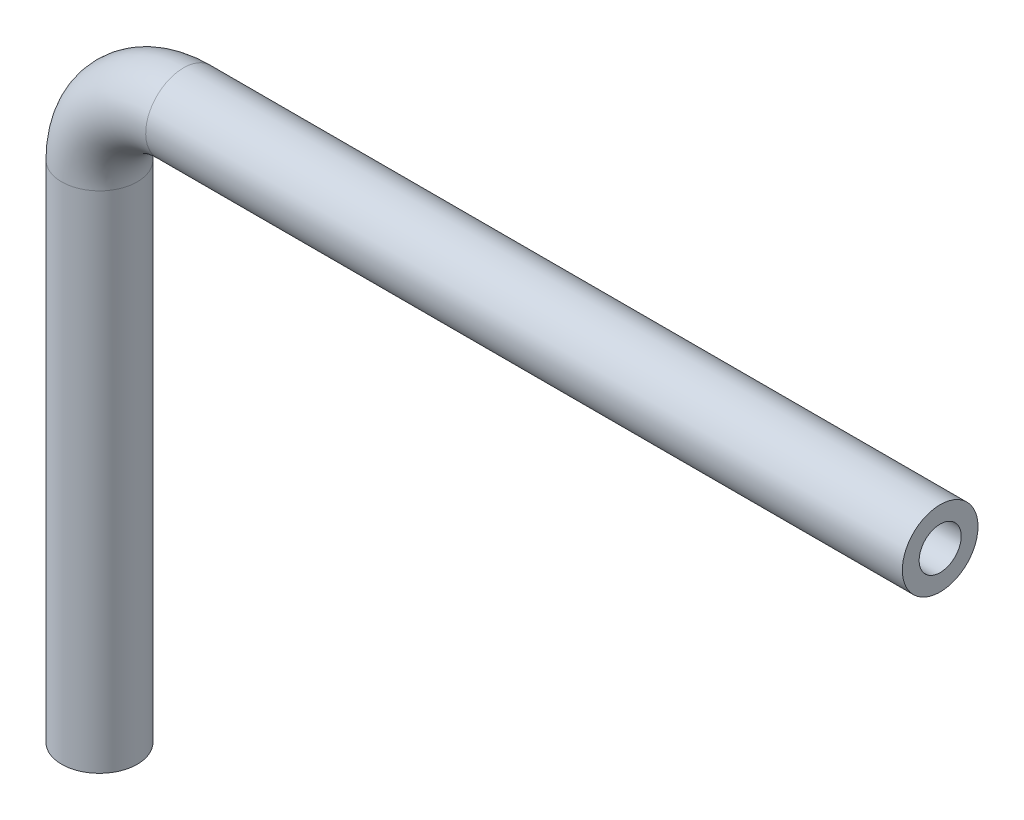
ISO-10303-21;
HEADER;
FILE_DESCRIPTION(('STEP AP214'),'2;1');
FILE_NAME('part.step','',(''),(''),'','','');
FILE_SCHEMA(('AUTOMOTIVE_DESIGN { 1 0 10303 214 1 1 1 1 }'));
ENDSEC;
DATA;
#1=APPLICATION_CONTEXT('core data for automotive mechanical design processes');
#2=APPLICATION_PROTOCOL_DEFINITION('international standard','automotive_design',2000,#1);
#3=PRODUCT_CONTEXT('',#1,'mechanical');
#4=PRODUCT('Part','Part','',(#3));
#5=PRODUCT_RELATED_PRODUCT_CATEGORY('part','',(#4));
#6=PRODUCT_DEFINITION_FORMATION('','',#4);
#7=PRODUCT_DEFINITION_CONTEXT('part definition',#1,'design');
#8=PRODUCT_DEFINITION('design','',#6,#7);
#9=PRODUCT_DEFINITION_SHAPE('','',#8);
#10=(LENGTH_UNIT() NAMED_UNIT(*) SI_UNIT(.MILLI.,.METRE.));
#11=(NAMED_UNIT(*) PLANE_ANGLE_UNIT() SI_UNIT($,.RADIAN.));
#12=(NAMED_UNIT(*) SI_UNIT($,.STERADIAN.) SOLID_ANGLE_UNIT());
#13=UNCERTAINTY_MEASURE_WITH_UNIT(LENGTH_MEASURE(1.E-05),#10,'distance_accuracy_value','');
#14=(GEOMETRIC_REPRESENTATION_CONTEXT(3) GLOBAL_UNCERTAINTY_ASSIGNED_CONTEXT((#13)) GLOBAL_UNIT_ASSIGNED_CONTEXT((#10,
#11,#12)) REPRESENTATION_CONTEXT('',''));
#15=CARTESIAN_POINT('',(0.,0.,0.));
#16=DIRECTION('',(0.,0.,1.));
#17=DIRECTION('',(1.,0.,0.));
#18=AXIS2_PLACEMENT_3D('',#15,#16,#17);
#19=CARTESIAN_POINT('',(0.999999999999999,6.,0.));
#20=DIRECTION('',(0.,0.,-1.));
#21=DIRECTION('',(-1.,0.,0.));
#22=AXIS2_PLACEMENT_3D('',#19,#20,#21);
#23=TOROIDAL_SURFACE('',#22,1.,0.25);
#24=CARTESIAN_POINT('',(0.,6.,0.));
#25=DIRECTION('',(0.,-1.,0.));
#26=DIRECTION('',(0.,0.,-1.));
#27=AXIS2_PLACEMENT_3D('',#24,#25,#26);
#28=CIRCLE('',#27,0.25);
#29=CARTESIAN_POINT('',(-0.250000000000001,6.,0.));
#30=VERTEX_POINT('',#29);
#31=EDGE_CURVE('E73',#30,#30,#28,.T.);
#32=CARTESIAN_POINT('',(0.999999999999997,7.,0.));
#33=DIRECTION('',(-1.,0.,0.));
#34=DIRECTION('',(0.,0.,1.));
#35=AXIS2_PLACEMENT_3D('',#32,#33,#34);
#36=CIRCLE('',#35,0.25);
#37=CARTESIAN_POINT('',(0.999999999999997,7.25,0.));
#38=VERTEX_POINT('',#37);
#39=EDGE_CURVE('E69',#38,#38,#36,.T.);
#40=CARTESIAN_POINT('',(0.999999999999999,6.,0.));
#41=DIRECTION('',(0.,0.,-1.));
#42=DIRECTION('',(-1.,0.,0.));
#43=AXIS2_PLACEMENT_3D('',#40,#41,#42);
#44=CIRCLE('',#43,1.25);
#45=EDGE_CURVE('',#30,#38,#44,.T.);
#46=ORIENTED_EDGE('',*,*,#31,.T.);
#47=ORIENTED_EDGE('',*,*,#39,.F.);
#48=ORIENTED_EDGE('',*,*,#45,.T.);
#49=ORIENTED_EDGE('',*,*,#45,.F.);
#50=EDGE_LOOP('',(#46,#48,#47,#49));
#51=FACE_BOUND('',#50,.T.);
#52=ADVANCED_FACE('F41',(#51),#23,.F.);
#53=CARTESIAN_POINT('',(10.,7.,0.));
#54=DIRECTION('',(-1.,0.,0.));
#55=DIRECTION('',(0.,0.,1.));
#56=AXIS2_PLACEMENT_3D('',#53,#54,#55);
#57=CYLINDRICAL_SURFACE('',#56,0.25);
#58=CARTESIAN_POINT('',(10.,7.,0.));
#59=DIRECTION('',(-1.,0.,0.));
#60=DIRECTION('',(0.,0.,1.));
#61=AXIS2_PLACEMENT_3D('',#58,#59,#60);
#62=CIRCLE('',#61,0.25);
#63=CARTESIAN_POINT('',(10.,7.,0.25));
#64=VERTEX_POINT('',#63);
#65=EDGE_CURVE('E65',#64,#64,#62,.T.);
#66=ORIENTED_EDGE('',*,*,#65,.F.);
#67=EDGE_LOOP('',(#66));
#68=FACE_BOUND('',#67,.T.);
#69=ORIENTED_EDGE('',*,*,#39,.T.);
#70=EDGE_LOOP('',(#69));
#71=FACE_BOUND('',#70,.T.);
#72=ADVANCED_FACE('F99',(#68,#71),#57,.F.);
#73=CARTESIAN_POINT('',(0.999999999999999,6.,0.));
#74=DIRECTION('',(0.,0.,-1.));
#75=DIRECTION('',(-1.,0.,0.));
#76=AXIS2_PLACEMENT_3D('',#73,#74,#75);
#77=TOROIDAL_SURFACE('',#76,1.,0.45);
#78=CARTESIAN_POINT('',(0.,6.,0.));
#79=DIRECTION('',(0.,-1.,0.));
#80=DIRECTION('',(0.,0.,-1.));
#81=AXIS2_PLACEMENT_3D('',#78,#79,#80);
#82=CIRCLE('',#81,0.45);
#83=CARTESIAN_POINT('',(-0.450000000000001,6.,0.));
#84=VERTEX_POINT('',#83);
#85=EDGE_CURVE('E54',#84,#84,#82,.T.);
#86=CARTESIAN_POINT('',(0.999999999999999,7.,0.));
#87=DIRECTION('',(1.,0.,0.));
#88=DIRECTION('',(0.,0.,1.));
#89=AXIS2_PLACEMENT_3D('',#86,#87,#88);
#90=CIRCLE('',#89,0.45);
#91=CARTESIAN_POINT('',(0.999999999999999,7.45,0.));
#92=VERTEX_POINT('',#91);
#93=EDGE_CURVE('E10',#92,#92,#90,.T.);
#94=CARTESIAN_POINT('',(0.999999999999999,6.,0.));
#95=DIRECTION('',(0.,0.,-1.));
#96=DIRECTION('',(-1.,0.,0.));
#97=AXIS2_PLACEMENT_3D('',#94,#95,#96);
#98=CIRCLE('',#97,1.45);
#99=EDGE_CURVE('',#84,#92,#98,.T.);
#100=ORIENTED_EDGE('',*,*,#85,.F.);
#101=ORIENTED_EDGE('',*,*,#93,.F.);
#102=ORIENTED_EDGE('',*,*,#99,.T.);
#103=ORIENTED_EDGE('',*,*,#99,.F.);
#104=EDGE_LOOP('',(#100,#102,#101,#103));
#105=FACE_BOUND('',#104,.T.);
#106=ADVANCED_FACE('F43',(#105),#77,.T.);
#107=CARTESIAN_POINT('',(0.,0.,0.));
#108=DIRECTION('',(0.,1.,0.));
#109=DIRECTION('',(0.,0.,1.));
#110=AXIS2_PLACEMENT_3D('',#107,#108,#109);
#111=CYLINDRICAL_SURFACE('',#110,0.45);
#112=CARTESIAN_POINT('',(0.,0.,0.));
#113=DIRECTION('',(0.,-1.,0.));
#114=DIRECTION('',(0.,0.,-1.));
#115=AXIS2_PLACEMENT_3D('',#112,#113,#114);
#116=CIRCLE('',#115,0.45);
#117=CARTESIAN_POINT('',(0.,0.,-0.45));
#118=VERTEX_POINT('',#117);
#119=EDGE_CURVE('E49',#118,#118,#116,.T.);
#120=ORIENTED_EDGE('',*,*,#119,.F.);
#121=EDGE_LOOP('',(#120));
#122=FACE_BOUND('',#121,.T.);
#123=ORIENTED_EDGE('',*,*,#85,.T.);
#124=EDGE_LOOP('',(#123));
#125=FACE_BOUND('',#124,.T.);
#126=ADVANCED_FACE('F87',(#122,#125),#111,.T.);
#127=CARTESIAN_POINT('',(0.,0.,0.));
#128=DIRECTION('',(0.,-1.,0.));
#129=DIRECTION('',(0.,0.,-1.));
#130=AXIS2_PLACEMENT_3D('',#127,#128,#129);
#131=PLANE('',#130);
#132=CARTESIAN_POINT('',(0.,0.,0.));
#133=DIRECTION('',(0.,-1.,0.));
#134=DIRECTION('',(0.,0.,-1.));
#135=AXIS2_PLACEMENT_3D('',#132,#133,#134);
#136=CIRCLE('',#135,0.25);
#137=CARTESIAN_POINT('',(0.,0.,-0.25));
#138=VERTEX_POINT('',#137);
#139=EDGE_CURVE('E77',#138,#138,#136,.T.);
#140=ORIENTED_EDGE('',*,*,#139,.F.);
#141=EDGE_LOOP('',(#140));
#142=FACE_BOUND('',#141,.T.);
#143=ORIENTED_EDGE('',*,*,#119,.T.);
#144=EDGE_LOOP('',(#143));
#145=FACE_BOUND('',#144,.T.);
#146=ADVANCED_FACE('F84',(#142,#145),#131,.T.);
#147=CARTESIAN_POINT('',(10.,7.,0.));
#148=DIRECTION('',(-1.,0.,0.));
#149=DIRECTION('',(0.,0.,1.));
#150=AXIS2_PLACEMENT_3D('',#147,#148,#149);
#151=CYLINDRICAL_SURFACE('',#150,0.45);
#152=CARTESIAN_POINT('',(10.,7.,0.));
#153=DIRECTION('',(1.,0.,0.));
#154=DIRECTION('',(0.,0.,-1.));
#155=AXIS2_PLACEMENT_3D('',#152,#153,#154);
#156=CIRCLE('',#155,0.45);
#157=CARTESIAN_POINT('',(10.,7.,-0.45));
#158=VERTEX_POINT('',#157);
#159=EDGE_CURVE('E60',#158,#158,#156,.T.);
#160=ORIENTED_EDGE('',*,*,#159,.F.);
#161=EDGE_LOOP('',(#160));
#162=FACE_BOUND('',#161,.T.);
#163=ORIENTED_EDGE('',*,*,#93,.T.);
#164=EDGE_LOOP('',(#163));
#165=FACE_BOUND('',#164,.T.);
#166=ADVANCED_FACE('F86',(#162,#165),#151,.T.);
#167=CARTESIAN_POINT('',(10.,7.,0.));
#168=DIRECTION('',(1.,0.,0.));
#169=DIRECTION('',(0.,0.,-1.));
#170=AXIS2_PLACEMENT_3D('',#167,#168,#169);
#171=PLANE('',#170);
#172=ORIENTED_EDGE('',*,*,#65,.T.);
#173=EDGE_LOOP('',(#172));
#174=FACE_BOUND('',#173,.T.);
#175=ORIENTED_EDGE('',*,*,#159,.T.);
#176=EDGE_LOOP('',(#175));
#177=FACE_BOUND('',#176,.T.);
#178=ADVANCED_FACE('F93',(#174,#177),#171,.T.);
#179=CARTESIAN_POINT('',(0.,6.,0.));
#180=DIRECTION('',(0.,-1.,0.));
#181=DIRECTION('',(0.,0.,-1.));
#182=AXIS2_PLACEMENT_3D('',#179,#180,#181);
#183=CYLINDRICAL_SURFACE('',#182,0.25);
#184=ORIENTED_EDGE('',*,*,#31,.F.);
#185=EDGE_LOOP('',(#184));
#186=FACE_BOUND('',#185,.T.);
#187=ORIENTED_EDGE('',*,*,#139,.T.);
#188=EDGE_LOOP('',(#187));
#189=FACE_BOUND('',#188,.T.);
#190=ADVANCED_FACE('F82',(#186,#189),#183,.F.);
#191=CLOSED_SHELL('',(#52,#72,#106,#126,#146,#166,#178,#190));
#192=MANIFOLD_SOLID_BREP('B2',#191);
#193=ADVANCED_BREP_SHAPE_REPRESENTATION('',(#18,#192),#14);
#194=SHAPE_DEFINITION_REPRESENTATION(#9,#193);
ENDSEC;
END-ISO-10303-21;
